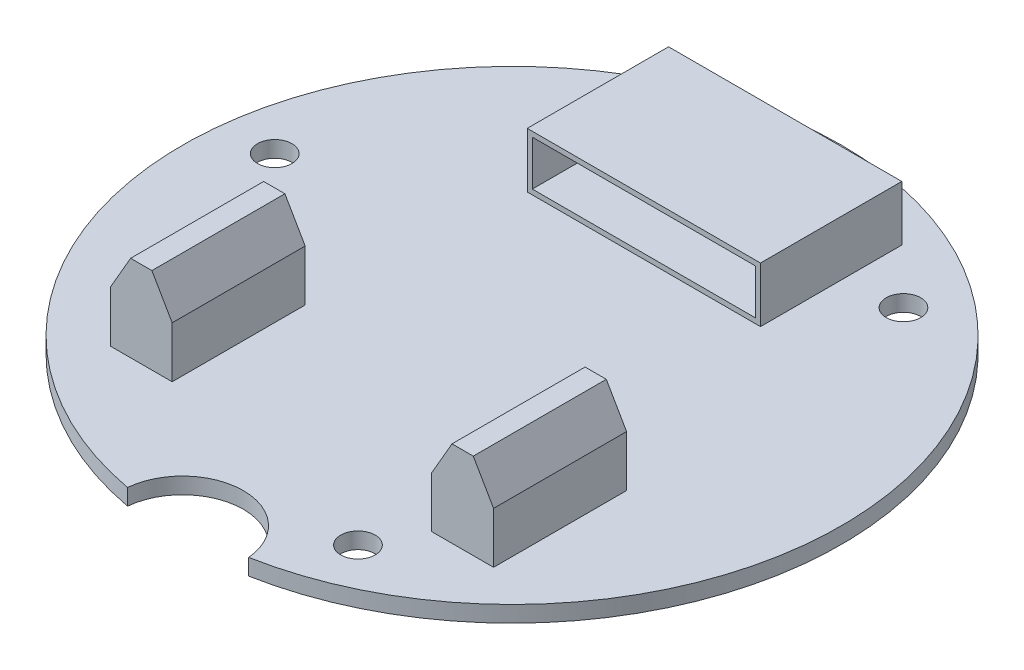
ISO-10303-21;
HEADER;
FILE_DESCRIPTION(('STEP AP214'),'2;1');
FILE_NAME('part.step','',(''),(''),'','','');
FILE_SCHEMA(('AUTOMOTIVE_DESIGN { 1 0 10303 214 1 1 1 1 }'));
ENDSEC;
DATA;
#1=APPLICATION_CONTEXT('core data for automotive mechanical design processes');
#2=APPLICATION_PROTOCOL_DEFINITION('international standard','automotive_design',2000,#1);
#3=PRODUCT_CONTEXT('',#1,'mechanical');
#4=PRODUCT('Part','Part','',(#3));
#5=PRODUCT_RELATED_PRODUCT_CATEGORY('part','',(#4));
#6=PRODUCT_DEFINITION_FORMATION('','',#4);
#7=PRODUCT_DEFINITION_CONTEXT('part definition',#1,'design');
#8=PRODUCT_DEFINITION('design','',#6,#7);
#9=PRODUCT_DEFINITION_SHAPE('','',#8);
#10=(LENGTH_UNIT() NAMED_UNIT(*) SI_UNIT(.MILLI.,.METRE.));
#11=(NAMED_UNIT(*) PLANE_ANGLE_UNIT() SI_UNIT($,.RADIAN.));
#12=(NAMED_UNIT(*) SI_UNIT($,.STERADIAN.) SOLID_ANGLE_UNIT());
#13=UNCERTAINTY_MEASURE_WITH_UNIT(LENGTH_MEASURE(1.E-05),#10,'distance_accuracy_value','');
#14=(GEOMETRIC_REPRESENTATION_CONTEXT(3) GLOBAL_UNCERTAINTY_ASSIGNED_CONTEXT((#13)) GLOBAL_UNIT_ASSIGNED_CONTEXT((#10,
#11,#12)) REPRESENTATION_CONTEXT('',''));
#15=CARTESIAN_POINT('',(0.,0.,0.));
#16=DIRECTION('',(0.,0.,1.));
#17=DIRECTION('',(1.,0.,0.));
#18=AXIS2_PLACEMENT_3D('',#15,#16,#17);
#19=CARTESIAN_POINT('',(0.,0.,16.25));
#20=DIRECTION('',(0.,1.,0.));
#21=DIRECTION('',(0.,0.,1.));
#22=AXIS2_PLACEMENT_3D('',#19,#20,#21);
#23=PLANE('',#22);
#24=DIRECTION('',(-1.,0.,0.));
#25=VECTOR('',#24,1.);
#26=CARTESIAN_POINT('',(12.8,0.,20.7191));
#27=LINE('',#26,#25);
#28=CARTESIAN_POINT('',(18.896,0.,20.7191));
#29=VERTEX_POINT('',#28);
#30=CARTESIAN_POINT('',(12.8,0.,20.7191));
#31=VERTEX_POINT('',#30);
#32=EDGE_CURVE('E256',#29,#31,#27,.T.);
#33=ORIENTED_EDGE('',*,*,#32,.F.);
#34=DIRECTION('',(0.,0.,1.));
#35=VECTOR('',#34,1.);
#36=CARTESIAN_POINT('',(18.896,0.,20.7191));
#37=LINE('',#36,#35);
#38=CARTESIAN_POINT('',(18.896,0.,7.6));
#39=VERTEX_POINT('',#38);
#40=EDGE_CURVE('E269',#39,#29,#37,.T.);
#41=ORIENTED_EDGE('',*,*,#40,.F.);
#42=DIRECTION('',(1.,0.,0.));
#43=VECTOR('',#42,1.);
#44=CARTESIAN_POINT('',(12.8,0.,7.6));
#45=LINE('',#44,#43);
#46=CARTESIAN_POINT('',(12.8,0.,7.6));
#47=VERTEX_POINT('',#46);
#48=EDGE_CURVE('E278',#47,#39,#45,.T.);
#49=ORIENTED_EDGE('',*,*,#48,.F.);
#50=DIRECTION('',(0.,0.,-1.));
#51=VECTOR('',#50,1.);
#52=CARTESIAN_POINT('',(12.8,0.,20.7191));
#53=LINE('',#52,#51);
#54=EDGE_CURVE('E259',#31,#47,#53,.T.);
#55=ORIENTED_EDGE('',*,*,#54,.F.);
#56=EDGE_LOOP('',(#33,#41,#49,#55));
#57=FACE_BOUND('',#56,.T.);
#58=CARTESIAN_POINT('',(16.9306905714555,0.,-21.670295724185));
#59=DIRECTION('',(0.,1.,0.));
#60=DIRECTION('',(0.866025403784436,0.,-0.500000000000004));
#61=AXIS2_PLACEMENT_3D('',#58,#59,#60);
#62=CIRCLE('',#61,1.7);
#63=CARTESIAN_POINT('',(18.402933757889,0.,-22.520295724185));
#64=VERTEX_POINT('',#63);
#65=EDGE_CURVE('E406',#64,#64,#62,.T.);
#66=ORIENTED_EDGE('',*,*,#65,.T.);
#67=EDGE_LOOP('',(#66));
#68=FACE_BOUND('',#67,.T.);
#69=CARTESIAN_POINT('',(-27.2323718903932,0.,-3.82726027640151));
#70=DIRECTION('',(0.,1.,0.));
#71=DIRECTION('',(-0.866025403784443,0.,-0.499999999999992));
#72=AXIS2_PLACEMENT_3D('',#69,#70,#71);
#73=CIRCLE('',#72,1.7);
#74=CARTESIAN_POINT('',(-28.7046150768268,0.,-4.6772602764015));
#75=VERTEX_POINT('',#74);
#76=EDGE_CURVE('E405',#75,#75,#73,.T.);
#77=ORIENTED_EDGE('',*,*,#76,.T.);
#78=EDGE_LOOP('',(#77));
#79=FACE_BOUND('',#78,.T.);
#80=CARTESIAN_POINT('',(10.3016813189376,0.,25.4975560005866));
#81=DIRECTION('',(0.,1.,0.));
#82=DIRECTION('',(0.,0.,1.));
#83=AXIS2_PLACEMENT_3D('',#80,#81,#82);
#84=CIRCLE('',#83,1.7);
#85=CARTESIAN_POINT('',(10.3016813189376,0.,27.1975560005866));
#86=VERTEX_POINT('',#85);
#87=EDGE_CURVE('E418',#86,#86,#84,.T.);
#88=ORIENTED_EDGE('',*,*,#87,.T.);
#89=EDGE_LOOP('',(#88));
#90=FACE_BOUND('',#89,.T.);
#91=CARTESIAN_POINT('',(0.,0.,0.));
#92=DIRECTION('',(0.,1.,0.));
#93=DIRECTION('',(0.,0.,1.));
#94=AXIS2_PLACEMENT_3D('',#91,#92,#93);
#95=CIRCLE('',#94,32.5);
#96=CARTESIAN_POINT('',(5.9743831847204,0.,31.9461538461538));
#97=VERTEX_POINT('',#96);
#98=CARTESIAN_POINT('',(-5.9743831847204,0.,31.9461538461538));
#99=VERTEX_POINT('',#98);
#100=EDGE_CURVE('E421',#97,#99,#95,.T.);
#101=ORIENTED_EDGE('',*,*,#100,.F.);
#102=CARTESIAN_POINT('',(0.,0.,32.5));
#103=DIRECTION('',(0.,1.,0.));
#104=DIRECTION('',(0.,0.,1.));
#105=AXIS2_PLACEMENT_3D('',#102,#103,#104);
#106=CIRCLE('',#105,6.00000000000001);
#107=EDGE_CURVE('E427',#97,#99,#106,.T.);
#108=ORIENTED_EDGE('',*,*,#107,.T.);
#109=EDGE_LOOP('',(#101,#108));
#110=FACE_BOUND('',#109,.T.);
#111=DIRECTION('',(0.,0.,1.));
#112=VECTOR('',#111,1.);
#113=CARTESIAN_POINT('',(-12.8,0.,20.7191));
#114=LINE('',#113,#112);
#115=CARTESIAN_POINT('',(-12.8,0.,7.6));
#116=VERTEX_POINT('',#115);
#117=CARTESIAN_POINT('',(-12.8,0.,20.7191));
#118=VERTEX_POINT('',#117);
#119=EDGE_CURVE('E255',#116,#118,#114,.T.);
#120=ORIENTED_EDGE('',*,*,#119,.F.);
#121=DIRECTION('',(1.,0.,0.));
#122=VECTOR('',#121,1.);
#123=CARTESIAN_POINT('',(-12.8,0.,7.6));
#124=LINE('',#123,#122);
#125=CARTESIAN_POINT('',(-18.896,0.,7.6));
#126=VERTEX_POINT('',#125);
#127=EDGE_CURVE('E252',#126,#116,#124,.T.);
#128=ORIENTED_EDGE('',*,*,#127,.F.);
#129=DIRECTION('',(0.,0.,-1.));
#130=VECTOR('',#129,1.);
#131=CARTESIAN_POINT('',(-18.896,0.,20.7191));
#132=LINE('',#131,#130);
#133=CARTESIAN_POINT('',(-18.896,0.,20.7191));
#134=VERTEX_POINT('',#133);
#135=EDGE_CURVE('E59',#134,#126,#132,.T.);
#136=ORIENTED_EDGE('',*,*,#135,.F.);
#137=DIRECTION('',(-1.,0.,0.));
#138=VECTOR('',#137,1.);
#139=CARTESIAN_POINT('',(-12.8,0.,20.7191));
#140=LINE('',#139,#138);
#141=EDGE_CURVE('E54',#118,#134,#140,.T.);
#142=ORIENTED_EDGE('',*,*,#141,.F.);
#143=EDGE_LOOP('',(#120,#128,#136,#142));
#144=FACE_BOUND('',#143,.T.);
#145=ADVANCED_FACE('F38',(#57,#68,#79,#90,#110,#144),#23,.F.);
#146=CARTESIAN_POINT('',(0.,1.6,16.25));
#147=DIRECTION('',(0.,1.,0.));
#148=DIRECTION('',(0.,0.,1.));
#149=AXIS2_PLACEMENT_3D('',#146,#147,#148);
#150=PLANE('',#149);
#151=CARTESIAN_POINT('',(16.9306905714555,1.6,-21.670295724185));
#152=DIRECTION('',(0.,1.,0.));
#153=DIRECTION('',(0.866025403784436,0.,-0.500000000000004));
#154=AXIS2_PLACEMENT_3D('',#151,#152,#153);
#155=CIRCLE('',#154,1.7);
#156=CARTESIAN_POINT('',(18.402933757889,1.6,-22.520295724185));
#157=VERTEX_POINT('',#156);
#158=EDGE_CURVE('E409',#157,#157,#155,.T.);
#159=ORIENTED_EDGE('',*,*,#158,.F.);
#160=EDGE_LOOP('',(#159));
#161=FACE_BOUND('',#160,.T.);
#162=CARTESIAN_POINT('',(-27.2323718903932,1.6,-3.82726027640151));
#163=DIRECTION('',(0.,1.,0.));
#164=DIRECTION('',(-0.866025403784443,0.,-0.499999999999992));
#165=AXIS2_PLACEMENT_3D('',#162,#163,#164);
#166=CIRCLE('',#165,1.7);
#167=CARTESIAN_POINT('',(-28.7046150768268,1.6,-4.6772602764015));
#168=VERTEX_POINT('',#167);
#169=EDGE_CURVE('E410',#168,#168,#166,.T.);
#170=ORIENTED_EDGE('',*,*,#169,.F.);
#171=EDGE_LOOP('',(#170));
#172=FACE_BOUND('',#171,.T.);
#173=CARTESIAN_POINT('',(10.3016813189376,1.6,25.4975560005866));
#174=DIRECTION('',(0.,1.,0.));
#175=DIRECTION('',(0.,0.,1.));
#176=AXIS2_PLACEMENT_3D('',#173,#174,#175);
#177=CIRCLE('',#176,1.7);
#178=CARTESIAN_POINT('',(10.3016813189376,1.6,27.1975560005866));
#179=VERTEX_POINT('',#178);
#180=EDGE_CURVE('E413',#179,#179,#177,.T.);
#181=ORIENTED_EDGE('',*,*,#180,.F.);
#182=EDGE_LOOP('',(#181));
#183=FACE_BOUND('',#182,.T.);
#184=CARTESIAN_POINT('',(0.,1.6,0.));
#185=DIRECTION('',(0.,1.,0.));
#186=DIRECTION('',(0.,0.,1.));
#187=AXIS2_PLACEMENT_3D('',#184,#185,#186);
#188=CIRCLE('',#187,32.5);
#189=CARTESIAN_POINT('',(5.9743831847204,1.6,31.9461538461538));
#190=VERTEX_POINT('',#189);
#191=CARTESIAN_POINT('',(-5.9743831847204,1.6,31.9461538461538));
#192=VERTEX_POINT('',#191);
#193=EDGE_CURVE('E424',#190,#192,#188,.T.);
#194=ORIENTED_EDGE('',*,*,#193,.T.);
#195=CARTESIAN_POINT('',(0.,1.6,32.5));
#196=DIRECTION('',(0.,1.,0.));
#197=DIRECTION('',(0.,0.,1.));
#198=AXIS2_PLACEMENT_3D('',#195,#196,#197);
#199=CIRCLE('',#198,6.00000000000001);
#200=EDGE_CURVE('E426',#190,#192,#199,.T.);
#201=ORIENTED_EDGE('',*,*,#200,.F.);
#202=EDGE_LOOP('',(#194,#201));
#203=FACE_BOUND('',#202,.T.);
#204=DIRECTION('',(-1.,0.,0.));
#205=VECTOR('',#204,1.);
#206=CARTESIAN_POINT('',(11.5,1.6,-26.9342933363348));
#207=LINE('',#206,#205);
#208=CARTESIAN_POINT('',(11.5,1.6,-26.9342933363348));
#209=VERTEX_POINT('',#208);
#210=CARTESIAN_POINT('',(-11.5,1.6,-26.9342933363348));
#211=VERTEX_POINT('',#210);
#212=EDGE_CURVE('E400',#209,#211,#207,.T.);
#213=ORIENTED_EDGE('',*,*,#212,.F.);
#214=DIRECTION('',(0.,0.,-1.));
#215=VECTOR('',#214,1.);
#216=CARTESIAN_POINT('',(11.5,1.6,-13.));
#217=LINE('',#216,#215);
#218=CARTESIAN_POINT('',(11.5,1.6,-13.));
#219=VERTEX_POINT('',#218);
#220=EDGE_CURVE('E379',#219,#209,#217,.T.);
#221=ORIENTED_EDGE('',*,*,#220,.F.);
#222=DIRECTION('',(-1.,0.,0.));
#223=VECTOR('',#222,1.);
#224=CARTESIAN_POINT('',(11.5,1.6,-13.));
#225=LINE('',#224,#223);
#226=CARTESIAN_POINT('',(-11.5,1.6,-13.));
#227=VERTEX_POINT('',#226);
#228=EDGE_CURVE('E403',#219,#227,#225,.T.);
#229=ORIENTED_EDGE('',*,*,#228,.T.);
#230=DIRECTION('',(0.,0.,-1.));
#231=VECTOR('',#230,1.);
#232=CARTESIAN_POINT('',(-11.5,1.6,-13.));
#233=LINE('',#232,#231);
#234=EDGE_CURVE('E390',#227,#211,#233,.T.);
#235=ORIENTED_EDGE('',*,*,#234,.T.);
#236=EDGE_LOOP('',(#213,#221,#229,#235));
#237=FACE_BOUND('',#236,.T.);
#238=DIRECTION('',(0.,0.,-1.));
#239=VECTOR('',#238,1.);
#240=CARTESIAN_POINT('',(18.896,1.6,20.7191));
#241=LINE('',#240,#239);
#242=CARTESIAN_POINT('',(18.896,1.6,20.7191));
#243=VERTEX_POINT('',#242);
#244=CARTESIAN_POINT('',(18.896,1.6,7.6));
#245=VERTEX_POINT('',#244);
#246=EDGE_CURVE('E361',#243,#245,#241,.T.);
#247=ORIENTED_EDGE('',*,*,#246,.F.);
#248=DIRECTION('',(1.,0.,0.));
#249=VECTOR('',#248,1.);
#250=CARTESIAN_POINT('',(12.8,1.6,20.7191));
#251=LINE('',#250,#249);
#252=CARTESIAN_POINT('',(12.8,1.6,20.7191));
#253=VERTEX_POINT('',#252);
#254=EDGE_CURVE('E351',#253,#243,#251,.T.);
#255=ORIENTED_EDGE('',*,*,#254,.F.);
#256=DIRECTION('',(0.,0.,-1.));
#257=VECTOR('',#256,1.);
#258=CARTESIAN_POINT('',(12.8,1.6,20.7191));
#259=LINE('',#258,#257);
#260=CARTESIAN_POINT('',(12.8,1.6,7.6));
#261=VERTEX_POINT('',#260);
#262=EDGE_CURVE('E372',#253,#261,#259,.T.);
#263=ORIENTED_EDGE('',*,*,#262,.T.);
#264=DIRECTION('',(1.,0.,0.));
#265=VECTOR('',#264,1.);
#266=CARTESIAN_POINT('',(12.8,1.6,7.6));
#267=LINE('',#266,#265);
#268=EDGE_CURVE('E363',#261,#245,#267,.T.);
#269=ORIENTED_EDGE('',*,*,#268,.T.);
#270=EDGE_LOOP('',(#247,#255,#263,#269));
#271=FACE_BOUND('',#270,.T.);
#272=DIRECTION('',(0.,0.,-1.));
#273=VECTOR('',#272,1.);
#274=CARTESIAN_POINT('',(-12.8,1.6,20.7191));
#275=LINE('',#274,#273);
#276=CARTESIAN_POINT('',(-12.8,1.6,20.7191));
#277=VERTEX_POINT('',#276);
#278=CARTESIAN_POINT('',(-12.8,1.6,7.6));
#279=VERTEX_POINT('',#278);
#280=EDGE_CURVE('E334',#277,#279,#275,.T.);
#281=ORIENTED_EDGE('',*,*,#280,.F.);
#282=DIRECTION('',(-1.,0.,0.));
#283=VECTOR('',#282,1.);
#284=CARTESIAN_POINT('',(-12.8,1.6,20.7191));
#285=LINE('',#284,#283);
#286=CARTESIAN_POINT('',(-18.896,1.6,20.7191));
#287=VERTEX_POINT('',#286);
#288=EDGE_CURVE('E332',#277,#287,#285,.T.);
#289=ORIENTED_EDGE('',*,*,#288,.T.);
#290=DIRECTION('',(0.,0.,-1.));
#291=VECTOR('',#290,1.);
#292=CARTESIAN_POINT('',(-18.896,1.6,20.7191));
#293=LINE('',#292,#291);
#294=CARTESIAN_POINT('',(-18.896,1.6,7.6));
#295=VERTEX_POINT('',#294);
#296=EDGE_CURVE('E346',#287,#295,#293,.T.);
#297=ORIENTED_EDGE('',*,*,#296,.T.);
#298=DIRECTION('',(-1.,0.,0.));
#299=VECTOR('',#298,1.);
#300=CARTESIAN_POINT('',(-12.8,1.6,7.6));
#301=LINE('',#300,#299);
#302=EDGE_CURVE('E326',#279,#295,#301,.T.);
#303=ORIENTED_EDGE('',*,*,#302,.F.);
#304=EDGE_LOOP('',(#281,#289,#297,#303));
#305=FACE_BOUND('',#304,.T.);
#306=ADVANCED_FACE('F499',(#161,#172,#183,#203,#237,#271,#305),#150,.T.);
#307=CARTESIAN_POINT('',(0.,1.6,0.));
#308=DIRECTION('',(0.,-1.,0.));
#309=DIRECTION('',(0.,0.,-1.));
#310=AXIS2_PLACEMENT_3D('',#307,#308,#309);
#311=CYLINDRICAL_SURFACE('',#310,32.5);
#312=ORIENTED_EDGE('',*,*,#100,.T.);
#313=DIRECTION('',(0.,-1.,0.));
#314=VECTOR('',#313,1.);
#315=CARTESIAN_POINT('',(-5.9743831847204,1.6,31.9461538461538));
#316=LINE('',#315,#314);
#317=EDGE_CURVE('E436',#192,#99,#316,.T.);
#318=ORIENTED_EDGE('',*,*,#317,.F.);
#319=ORIENTED_EDGE('',*,*,#193,.F.);
#320=DIRECTION('',(0.,-1.,0.));
#321=VECTOR('',#320,1.);
#322=CARTESIAN_POINT('',(5.9743831847204,1.6,31.9461538461538));
#323=LINE('',#322,#321);
#324=EDGE_CURVE('E430',#190,#97,#323,.T.);
#325=ORIENTED_EDGE('',*,*,#324,.T.);
#326=EDGE_LOOP('',(#312,#318,#319,#325));
#327=FACE_BOUND('',#326,.T.);
#328=ADVANCED_FACE('F501',(#327),#311,.T.);
#329=CARTESIAN_POINT('',(0.,1.6,32.5));
#330=DIRECTION('',(0.,-1.,0.));
#331=DIRECTION('',(0.,0.,-1.));
#332=AXIS2_PLACEMENT_3D('',#329,#330,#331);
#333=CYLINDRICAL_SURFACE('',#332,6.00000000000001);
#334=ORIENTED_EDGE('',*,*,#107,.F.);
#335=ORIENTED_EDGE('',*,*,#324,.F.);
#336=ORIENTED_EDGE('',*,*,#200,.T.);
#337=ORIENTED_EDGE('',*,*,#317,.T.);
#338=EDGE_LOOP('',(#334,#335,#336,#337));
#339=FACE_BOUND('',#338,.T.);
#340=ADVANCED_FACE('F508',(#339),#333,.F.);
#341=CARTESIAN_POINT('',(10.3016813189376,0.,25.4975560005866));
#342=DIRECTION('',(0.,1.,0.));
#343=DIRECTION('',(0.,0.,1.));
#344=AXIS2_PLACEMENT_3D('',#341,#342,#343);
#345=CYLINDRICAL_SURFACE('',#344,1.7);
#346=ORIENTED_EDGE('',*,*,#87,.F.);
#347=EDGE_LOOP('',(#346));
#348=FACE_BOUND('',#347,.T.);
#349=ORIENTED_EDGE('',*,*,#180,.T.);
#350=EDGE_LOOP('',(#349));
#351=FACE_BOUND('',#350,.T.);
#352=ADVANCED_FACE('F516',(#348,#351),#345,.F.);
#353=CARTESIAN_POINT('',(-27.2323718903932,0.,-3.82726027640151));
#354=DIRECTION('',(0.,1.,0.));
#355=DIRECTION('',(-0.866025403784443,0.,-0.499999999999992));
#356=AXIS2_PLACEMENT_3D('',#353,#354,#355);
#357=CYLINDRICAL_SURFACE('',#356,1.7);
#358=ORIENTED_EDGE('',*,*,#76,.F.);
#359=EDGE_LOOP('',(#358));
#360=FACE_BOUND('',#359,.T.);
#361=ORIENTED_EDGE('',*,*,#169,.T.);
#362=EDGE_LOOP('',(#361));
#363=FACE_BOUND('',#362,.T.);
#364=ADVANCED_FACE('F599',(#360,#363),#357,.F.);
#365=CARTESIAN_POINT('',(16.9306905714555,0.,-21.670295724185));
#366=DIRECTION('',(0.,1.,0.));
#367=DIRECTION('',(0.866025403784436,0.,-0.500000000000004));
#368=AXIS2_PLACEMENT_3D('',#365,#366,#367);
#369=CYLINDRICAL_SURFACE('',#368,1.7);
#370=ORIENTED_EDGE('',*,*,#65,.F.);
#371=EDGE_LOOP('',(#370));
#372=FACE_BOUND('',#371,.T.);
#373=ORIENTED_EDGE('',*,*,#158,.T.);
#374=EDGE_LOOP('',(#373));
#375=FACE_BOUND('',#374,.T.);
#376=ADVANCED_FACE('F596',(#372,#375),#369,.F.);
#377=CARTESIAN_POINT('',(11.5,1.6,-13.));
#378=DIRECTION('',(0.,0.,-1.));
#379=DIRECTION('',(0.,1.,0.));
#380=AXIS2_PLACEMENT_3D('',#377,#378,#379);
#381=PLANE('',#380);
#382=DIRECTION('',(0.,-1.,0.));
#383=VECTOR('',#382,1.);
#384=CARTESIAN_POINT('',(-11.,6.5356,-13.));
#385=LINE('',#384,#383);
#386=CARTESIAN_POINT('',(-11.,6.5356,-13.));
#387=VERTEX_POINT('',#386);
#388=CARTESIAN_POINT('',(-11.,2.1,-13.));
#389=VERTEX_POINT('',#388);
#390=EDGE_CURVE('E304',#387,#389,#385,.T.);
#391=ORIENTED_EDGE('',*,*,#390,.F.);
#392=DIRECTION('',(-1.,0.,0.));
#393=VECTOR('',#392,1.);
#394=CARTESIAN_POINT('',(11.,6.5356,-13.));
#395=LINE('',#394,#393);
#396=CARTESIAN_POINT('',(11.,6.5356,-13.));
#397=VERTEX_POINT('',#396);
#398=EDGE_CURVE('E294',#397,#387,#395,.T.);
#399=ORIENTED_EDGE('',*,*,#398,.F.);
#400=DIRECTION('',(0.,1.,0.));
#401=VECTOR('',#400,1.);
#402=CARTESIAN_POINT('',(11.,2.1,-13.));
#403=LINE('',#402,#401);
#404=CARTESIAN_POINT('',(11.,2.1,-13.));
#405=VERTEX_POINT('',#404);
#406=EDGE_CURVE('E310',#405,#397,#403,.T.);
#407=ORIENTED_EDGE('',*,*,#406,.F.);
#408=DIRECTION('',(1.,0.,0.));
#409=VECTOR('',#408,1.);
#410=CARTESIAN_POINT('',(-11.,2.1,-13.));
#411=LINE('',#410,#409);
#412=EDGE_CURVE('E307',#389,#405,#411,.T.);
#413=ORIENTED_EDGE('',*,*,#412,.F.);
#414=EDGE_LOOP('',(#391,#399,#407,#413));
#415=FACE_BOUND('',#414,.T.);
#416=DIRECTION('',(0.,-1.,0.));
#417=VECTOR('',#416,1.);
#418=CARTESIAN_POINT('',(-11.5,1.6,-13.));
#419=LINE('',#418,#417);
#420=CARTESIAN_POINT('',(-11.5,7.0356,-13.));
#421=VERTEX_POINT('',#420);
#422=EDGE_CURVE('E375',#421,#227,#419,.T.);
#423=ORIENTED_EDGE('',*,*,#422,.T.);
#424=ORIENTED_EDGE('',*,*,#228,.F.);
#425=DIRECTION('',(0.,-1.,0.));
#426=VECTOR('',#425,1.);
#427=CARTESIAN_POINT('',(11.5,1.6,-13.));
#428=LINE('',#427,#426);
#429=CARTESIAN_POINT('',(11.5,7.0356,-13.));
#430=VERTEX_POINT('',#429);
#431=EDGE_CURVE('E376',#430,#219,#428,.T.);
#432=ORIENTED_EDGE('',*,*,#431,.F.);
#433=DIRECTION('',(-1.,0.,0.));
#434=VECTOR('',#433,1.);
#435=CARTESIAN_POINT('',(11.5,7.0356,-13.));
#436=LINE('',#435,#434);
#437=EDGE_CURVE('E387',#430,#421,#436,.T.);
#438=ORIENTED_EDGE('',*,*,#437,.T.);
#439=EDGE_LOOP('',(#423,#424,#432,#438));
#440=FACE_BOUND('',#439,.T.);
#441=ADVANCED_FACE('F592',(#415,#440),#381,.F.);
#442=CARTESIAN_POINT('',(11.5,1.6,-26.9342933363348));
#443=DIRECTION('',(0.,0.,1.));
#444=DIRECTION('',(1.,0.,0.));
#445=AXIS2_PLACEMENT_3D('',#442,#443,#444);
#446=PLANE('',#445);
#447=DIRECTION('',(0.,1.,0.));
#448=VECTOR('',#447,1.);
#449=CARTESIAN_POINT('',(-11.5,1.6,-26.9342933363348));
#450=LINE('',#449,#448);
#451=CARTESIAN_POINT('',(-11.5,7.0356,-26.9342933363348));
#452=VERTEX_POINT('',#451);
#453=EDGE_CURVE('E392',#211,#452,#450,.T.);
#454=ORIENTED_EDGE('',*,*,#453,.T.);
#455=DIRECTION('',(-1.,0.,0.));
#456=VECTOR('',#455,1.);
#457=CARTESIAN_POINT('',(11.5,7.0356,-26.9342933363348));
#458=LINE('',#457,#456);
#459=CARTESIAN_POINT('',(11.5,7.0356,-26.9342933363348));
#460=VERTEX_POINT('',#459);
#461=EDGE_CURVE('E397',#460,#452,#458,.T.);
#462=ORIENTED_EDGE('',*,*,#461,.F.);
#463=DIRECTION('',(0.,1.,0.));
#464=VECTOR('',#463,1.);
#465=CARTESIAN_POINT('',(11.5,1.6,-26.9342933363348));
#466=LINE('',#465,#464);
#467=EDGE_CURVE('E383',#209,#460,#466,.T.);
#468=ORIENTED_EDGE('',*,*,#467,.F.);
#469=ORIENTED_EDGE('',*,*,#212,.T.);
#470=EDGE_LOOP('',(#454,#462,#468,#469));
#471=FACE_BOUND('',#470,.T.);
#472=ADVANCED_FACE('F588',(#471),#446,.F.);
#473=CARTESIAN_POINT('',(11.5,7.0356,-13.));
#474=DIRECTION('',(0.,-1.,0.));
#475=DIRECTION('',(0.,0.,-1.));
#476=AXIS2_PLACEMENT_3D('',#473,#474,#475);
#477=PLANE('',#476);
#478=DIRECTION('',(0.,0.,1.));
#479=VECTOR('',#478,1.);
#480=CARTESIAN_POINT('',(-11.5,7.0356,-13.));
#481=LINE('',#480,#479);
#482=EDGE_CURVE('E380',#452,#421,#481,.T.);
#483=ORIENTED_EDGE('',*,*,#482,.T.);
#484=ORIENTED_EDGE('',*,*,#437,.F.);
#485=DIRECTION('',(0.,0.,1.));
#486=VECTOR('',#485,1.);
#487=CARTESIAN_POINT('',(11.5,7.0356,-13.));
#488=LINE('',#487,#486);
#489=EDGE_CURVE('E385',#460,#430,#488,.T.);
#490=ORIENTED_EDGE('',*,*,#489,.F.);
#491=ORIENTED_EDGE('',*,*,#461,.T.);
#492=EDGE_LOOP('',(#483,#484,#490,#491));
#493=FACE_BOUND('',#492,.T.);
#494=ADVANCED_FACE('F581',(#493),#477,.F.);
#495=CARTESIAN_POINT('',(11.5,0.,0.));
#496=DIRECTION('',(-1.,0.,0.));
#497=DIRECTION('',(0.,0.,1.));
#498=AXIS2_PLACEMENT_3D('',#495,#496,#497);
#499=PLANE('',#498);
#500=ORIENTED_EDGE('',*,*,#431,.T.);
#501=ORIENTED_EDGE('',*,*,#220,.T.);
#502=ORIENTED_EDGE('',*,*,#467,.T.);
#503=ORIENTED_EDGE('',*,*,#489,.T.);
#504=EDGE_LOOP('',(#500,#501,#502,#503));
#505=FACE_BOUND('',#504,.T.);
#506=ADVANCED_FACE('F578',(#505),#499,.F.);
#507=CARTESIAN_POINT('',(-11.5,0.,0.));
#508=DIRECTION('',(-1.,0.,0.));
#509=DIRECTION('',(0.,0.,1.));
#510=AXIS2_PLACEMENT_3D('',#507,#508,#509);
#511=PLANE('',#510);
#512=ORIENTED_EDGE('',*,*,#422,.F.);
#513=ORIENTED_EDGE('',*,*,#482,.F.);
#514=ORIENTED_EDGE('',*,*,#453,.F.);
#515=ORIENTED_EDGE('',*,*,#234,.F.);
#516=EDGE_LOOP('',(#512,#513,#514,#515));
#517=FACE_BOUND('',#516,.T.);
#518=ADVANCED_FACE('F576',(#517),#511,.T.);
#519=CARTESIAN_POINT('',(12.8,1.6,20.7191));
#520=DIRECTION('',(1.,0.,0.));
#521=DIRECTION('',(0.,0.,-1.));
#522=AXIS2_PLACEMENT_3D('',#519,#520,#521);
#523=PLANE('',#522);
#524=DIRECTION('',(0.,-1.,0.));
#525=VECTOR('',#524,1.);
#526=CARTESIAN_POINT('',(12.8,1.6,20.7191));
#527=LINE('',#526,#525);
#528=CARTESIAN_POINT('',(12.8,6.63589838486226,20.7191));
#529=VERTEX_POINT('',#528);
#530=EDGE_CURVE('E349',#529,#253,#527,.T.);
#531=ORIENTED_EDGE('',*,*,#530,.F.);
#532=DIRECTION('',(0.,0.,-1.));
#533=VECTOR('',#532,1.);
#534=CARTESIAN_POINT('',(12.8,6.63589838486226,20.7191));
#535=LINE('',#534,#533);
#536=CARTESIAN_POINT('',(12.8,6.63589838486226,7.6));
#537=VERTEX_POINT('',#536);
#538=EDGE_CURVE('E453',#529,#537,#535,.T.);
#539=ORIENTED_EDGE('',*,*,#538,.T.);
#540=DIRECTION('',(0.,-1.,0.));
#541=VECTOR('',#540,1.);
#542=CARTESIAN_POINT('',(12.8,1.6,7.6));
#543=LINE('',#542,#541);
#544=EDGE_CURVE('E348',#537,#261,#543,.T.);
#545=ORIENTED_EDGE('',*,*,#544,.T.);
#546=ORIENTED_EDGE('',*,*,#262,.F.);
#547=EDGE_LOOP('',(#531,#539,#545,#546));
#548=FACE_BOUND('',#547,.T.);
#549=ADVANCED_FACE('F572',(#548),#523,.F.);
#550=CARTESIAN_POINT('',(18.896,1.6,20.7191));
#551=DIRECTION('',(-1.,0.,0.));
#552=DIRECTION('',(0.,0.,1.));
#553=AXIS2_PLACEMENT_3D('',#550,#551,#552);
#554=PLANE('',#553);
#555=DIRECTION('',(0.,1.,0.));
#556=VECTOR('',#555,1.);
#557=CARTESIAN_POINT('',(18.896,1.6,7.6));
#558=LINE('',#557,#556);
#559=CARTESIAN_POINT('',(18.896,6.63589838486226,7.6));
#560=VERTEX_POINT('',#559);
#561=EDGE_CURVE('E365',#245,#560,#558,.T.);
#562=ORIENTED_EDGE('',*,*,#561,.T.);
#563=DIRECTION('',(0.,0.,1.));
#564=VECTOR('',#563,1.);
#565=CARTESIAN_POINT('',(18.896,6.63589838486226,20.7191));
#566=LINE('',#565,#564);
#567=CARTESIAN_POINT('',(18.896,6.63589838486226,20.7191));
#568=VERTEX_POINT('',#567);
#569=EDGE_CURVE('E447',#560,#568,#566,.T.);
#570=ORIENTED_EDGE('',*,*,#569,.T.);
#571=DIRECTION('',(0.,1.,0.));
#572=VECTOR('',#571,1.);
#573=CARTESIAN_POINT('',(18.896,1.6,20.7191));
#574=LINE('',#573,#572);
#575=EDGE_CURVE('E355',#243,#568,#574,.T.);
#576=ORIENTED_EDGE('',*,*,#575,.F.);
#577=ORIENTED_EDGE('',*,*,#246,.T.);
#578=EDGE_LOOP('',(#562,#570,#576,#577));
#579=FACE_BOUND('',#578,.T.);
#580=ADVANCED_FACE('F568',(#579),#554,.F.);
#581=CARTESIAN_POINT('',(12.8,10.1,20.7191));
#582=DIRECTION('',(0.,-1.,0.));
#583=DIRECTION('',(0.,0.,-1.));
#584=AXIS2_PLACEMENT_3D('',#581,#582,#583);
#585=PLANE('',#584);
#586=DIRECTION('',(-1.,0.,0.));
#587=VECTOR('',#586,1.);
#588=CARTESIAN_POINT('',(12.8,10.1,20.7191));
#589=LINE('',#588,#587);
#590=CARTESIAN_POINT('',(16.896,10.1,20.7191));
#591=VERTEX_POINT('',#590);
#592=CARTESIAN_POINT('',(14.8,10.1,20.7191));
#593=VERTEX_POINT('',#592);
#594=EDGE_CURVE('E358',#591,#593,#589,.T.);
#595=ORIENTED_EDGE('',*,*,#594,.F.);
#596=DIRECTION('',(0.,0.,-1.));
#597=VECTOR('',#596,1.);
#598=CARTESIAN_POINT('',(16.896,10.1,20.7191));
#599=LINE('',#598,#597);
#600=CARTESIAN_POINT('',(16.896,10.1,7.6));
#601=VERTEX_POINT('',#600);
#602=EDGE_CURVE('E440',#591,#601,#599,.T.);
#603=ORIENTED_EDGE('',*,*,#602,.T.);
#604=DIRECTION('',(-1.,0.,0.));
#605=VECTOR('',#604,1.);
#606=CARTESIAN_POINT('',(12.8,10.1,7.6));
#607=LINE('',#606,#605);
#608=CARTESIAN_POINT('',(14.8,10.1,7.6));
#609=VERTEX_POINT('',#608);
#610=EDGE_CURVE('E352',#601,#609,#607,.T.);
#611=ORIENTED_EDGE('',*,*,#610,.T.);
#612=DIRECTION('',(0.,0.,1.));
#613=VECTOR('',#612,1.);
#614=CARTESIAN_POINT('',(14.8,10.1,20.7191));
#615=LINE('',#614,#613);
#616=EDGE_CURVE('E438',#609,#593,#615,.T.);
#617=ORIENTED_EDGE('',*,*,#616,.T.);
#618=EDGE_LOOP('',(#595,#603,#611,#617));
#619=FACE_BOUND('',#618,.T.);
#620=ADVANCED_FACE('F561',(#619),#585,.F.);
#621=CARTESIAN_POINT('',(0.,0.,20.7191));
#622=DIRECTION('',(0.,0.,-1.));
#623=DIRECTION('',(-1.,0.,0.));
#624=AXIS2_PLACEMENT_3D('',#621,#622,#623);
#625=PLANE('',#624);
#626=ORIENTED_EDGE('',*,*,#575,.T.);
#627=DIRECTION('',(0.500000000000002,-0.866025403784438,0.));
#628=VECTOR('',#627,1.);
#629=CARTESIAN_POINT('',(16.896,10.1,20.7191));
#630=LINE('',#629,#628);
#631=EDGE_CURVE('E451',#568,#591,#630,.F.);
#632=ORIENTED_EDGE('',*,*,#631,.T.);
#633=ORIENTED_EDGE('',*,*,#594,.T.);
#634=DIRECTION('',(0.500000000000002,0.866025403784438,0.));
#635=VECTOR('',#634,1.);
#636=CARTESIAN_POINT('',(12.8,6.63589838486226,20.7191));
#637=LINE('',#636,#635);
#638=EDGE_CURVE('E449',#593,#529,#637,.F.);
#639=ORIENTED_EDGE('',*,*,#638,.T.);
#640=ORIENTED_EDGE('',*,*,#530,.T.);
#641=ORIENTED_EDGE('',*,*,#254,.T.);
#642=EDGE_LOOP('',(#626,#632,#633,#639,#640,#641));
#643=FACE_BOUND('',#642,.T.);
#644=ADVANCED_FACE('F558',(#643),#625,.F.);
#645=CARTESIAN_POINT('',(0.,0.,7.6));
#646=DIRECTION('',(0.,0.,-1.));
#647=DIRECTION('',(-1.,0.,0.));
#648=AXIS2_PLACEMENT_3D('',#645,#646,#647);
#649=PLANE('',#648);
#650=ORIENTED_EDGE('',*,*,#610,.F.);
#651=DIRECTION('',(-0.500000000000002,0.866025403784438,0.));
#652=VECTOR('',#651,1.);
#653=CARTESIAN_POINT('',(17.0454282891114,9.84118261117097,7.6));
#654=LINE('',#653,#652);
#655=EDGE_CURVE('E445',#601,#560,#654,.F.);
#656=ORIENTED_EDGE('',*,*,#655,.T.);
#657=ORIENTED_EDGE('',*,*,#561,.F.);
#658=ORIENTED_EDGE('',*,*,#268,.F.);
#659=ORIENTED_EDGE('',*,*,#544,.F.);
#660=DIRECTION('',(-0.500000000000002,-0.866025403784438,0.));
#661=VECTOR('',#660,1.);
#662=CARTESIAN_POINT('',(6.72657171088855,-3.88358798800484,7.6));
#663=LINE('',#662,#661);
#664=EDGE_CURVE('E443',#537,#609,#663,.F.);
#665=ORIENTED_EDGE('',*,*,#664,.T.);
#666=EDGE_LOOP('',(#650,#656,#657,#658,#659,#665));
#667=FACE_BOUND('',#666,.T.);
#668=ADVANCED_FACE('F530',(#667),#649,.T.);
#669=CARTESIAN_POINT('',(16.896,10.1,20.7191));
#670=DIRECTION('',(-0.866025403784438,-0.500000000000002,0.));
#671=DIRECTION('',(0.,0.,-1.));
#672=AXIS2_PLACEMENT_3D('',#669,#670,#671);
#673=PLANE('',#672);
#674=ORIENTED_EDGE('',*,*,#631,.F.);
#675=ORIENTED_EDGE('',*,*,#569,.F.);
#676=ORIENTED_EDGE('',*,*,#655,.F.);
#677=ORIENTED_EDGE('',*,*,#602,.F.);
#678=EDGE_LOOP('',(#674,#675,#676,#677));
#679=FACE_BOUND('',#678,.T.);
#680=ADVANCED_FACE('F523',(#679),#673,.F.);
#681=CARTESIAN_POINT('',(12.8,6.63589838486226,20.7191));
#682=DIRECTION('',(0.866025403784438,-0.500000000000002,0.));
#683=DIRECTION('',(0.,0.,-1.));
#684=AXIS2_PLACEMENT_3D('',#681,#682,#683);
#685=PLANE('',#684);
#686=ORIENTED_EDGE('',*,*,#638,.F.);
#687=ORIENTED_EDGE('',*,*,#616,.F.);
#688=ORIENTED_EDGE('',*,*,#664,.F.);
#689=ORIENTED_EDGE('',*,*,#538,.F.);
#690=EDGE_LOOP('',(#686,#687,#688,#689));
#691=FACE_BOUND('',#690,.T.);
#692=ADVANCED_FACE('F529',(#691),#685,.F.);
#693=CARTESIAN_POINT('',(-12.8,1.6,20.7191));
#694=DIRECTION('',(1.,0.,0.));
#695=DIRECTION('',(0.,0.,-1.));
#696=AXIS2_PLACEMENT_3D('',#693,#694,#695);
#697=PLANE('',#696);
#698=DIRECTION('',(0.,-1.,0.));
#699=VECTOR('',#698,1.);
#700=CARTESIAN_POINT('',(-12.8,1.6,7.6));
#701=LINE('',#700,#699);
#702=CARTESIAN_POINT('',(-12.8,6.63589838486226,7.6));
#703=VERTEX_POINT('',#702);
#704=EDGE_CURVE('E322',#703,#279,#701,.T.);
#705=ORIENTED_EDGE('',*,*,#704,.F.);
#706=DIRECTION('',(0.,0.,1.));
#707=VECTOR('',#706,1.);
#708=CARTESIAN_POINT('',(-12.8,6.63589838486226,20.7191));
#709=LINE('',#708,#707);
#710=CARTESIAN_POINT('',(-12.8,6.63589838486226,20.7191));
#711=VERTEX_POINT('',#710);
#712=EDGE_CURVE('E12',#703,#711,#709,.T.);
#713=ORIENTED_EDGE('',*,*,#712,.T.);
#714=DIRECTION('',(0.,-1.,0.));
#715=VECTOR('',#714,1.);
#716=CARTESIAN_POINT('',(-12.8,1.6,20.7191));
#717=LINE('',#716,#715);
#718=EDGE_CURVE('E323',#711,#277,#717,.T.);
#719=ORIENTED_EDGE('',*,*,#718,.T.);
#720=ORIENTED_EDGE('',*,*,#280,.T.);
#721=EDGE_LOOP('',(#705,#713,#719,#720));
#722=FACE_BOUND('',#721,.T.);
#723=ADVANCED_FACE('F495',(#722),#697,.T.);
#724=CARTESIAN_POINT('',(-12.8,10.1,20.7191));
#725=DIRECTION('',(0.,1.,0.));
#726=DIRECTION('',(0.,0.,1.));
#727=AXIS2_PLACEMENT_3D('',#724,#725,#726);
#728=PLANE('',#727);
#729=DIRECTION('',(1.,0.,0.));
#730=VECTOR('',#729,1.);
#731=CARTESIAN_POINT('',(-12.8,10.1,7.6));
#732=LINE('',#731,#730);
#733=CARTESIAN_POINT('',(-16.896,10.1,7.6));
#734=VERTEX_POINT('',#733);
#735=CARTESIAN_POINT('',(-14.8,10.1,7.6));
#736=VERTEX_POINT('',#735);
#737=EDGE_CURVE('E336',#734,#736,#732,.T.);
#738=ORIENTED_EDGE('',*,*,#737,.F.);
#739=DIRECTION('',(0.,0.,1.));
#740=VECTOR('',#739,1.);
#741=CARTESIAN_POINT('',(-16.896,10.1,20.7191));
#742=LINE('',#741,#740);
#743=CARTESIAN_POINT('',(-16.896,10.1,20.7191));
#744=VERTEX_POINT('',#743);
#745=EDGE_CURVE('E466',#734,#744,#742,.T.);
#746=ORIENTED_EDGE('',*,*,#745,.T.);
#747=DIRECTION('',(1.,0.,0.));
#748=VECTOR('',#747,1.);
#749=CARTESIAN_POINT('',(-12.8,10.1,20.7191));
#750=LINE('',#749,#748);
#751=CARTESIAN_POINT('',(-14.8,10.1,20.7191));
#752=VERTEX_POINT('',#751);
#753=EDGE_CURVE('E325',#744,#752,#750,.T.);
#754=ORIENTED_EDGE('',*,*,#753,.T.);
#755=DIRECTION('',(0.,0.,-1.));
#756=VECTOR('',#755,1.);
#757=CARTESIAN_POINT('',(-14.8,10.1,20.7191));
#758=LINE('',#757,#756);
#759=EDGE_CURVE('E463',#752,#736,#758,.T.);
#760=ORIENTED_EDGE('',*,*,#759,.T.);
#761=EDGE_LOOP('',(#738,#746,#754,#760));
#762=FACE_BOUND('',#761,.T.);
#763=ADVANCED_FACE('F487',(#762),#728,.T.);
#764=CARTESIAN_POINT('',(-18.896,1.6,20.7191));
#765=DIRECTION('',(-1.,0.,0.));
#766=DIRECTION('',(0.,0.,1.));
#767=AXIS2_PLACEMENT_3D('',#764,#765,#766);
#768=PLANE('',#767);
#769=DIRECTION('',(0.,1.,0.));
#770=VECTOR('',#769,1.);
#771=CARTESIAN_POINT('',(-18.896,1.6,20.7191));
#772=LINE('',#771,#770);
#773=CARTESIAN_POINT('',(-18.896,6.63589838486226,20.7191));
#774=VERTEX_POINT('',#773);
#775=EDGE_CURVE('E329',#287,#774,#772,.T.);
#776=ORIENTED_EDGE('',*,*,#775,.T.);
#777=DIRECTION('',(0.,0.,-1.));
#778=VECTOR('',#777,1.);
#779=CARTESIAN_POINT('',(-18.896,6.63589838486226,20.7191));
#780=LINE('',#779,#778);
#781=CARTESIAN_POINT('',(-18.896,6.63589838486226,7.6));
#782=VERTEX_POINT('',#781);
#783=EDGE_CURVE('E456',#774,#782,#780,.T.);
#784=ORIENTED_EDGE('',*,*,#783,.T.);
#785=DIRECTION('',(0.,1.,0.));
#786=VECTOR('',#785,1.);
#787=CARTESIAN_POINT('',(-18.896,1.6,7.6));
#788=LINE('',#787,#786);
#789=EDGE_CURVE('E339',#295,#782,#788,.T.);
#790=ORIENTED_EDGE('',*,*,#789,.F.);
#791=ORIENTED_EDGE('',*,*,#296,.F.);
#792=EDGE_LOOP('',(#776,#784,#790,#791));
#793=FACE_BOUND('',#792,.T.);
#794=ADVANCED_FACE('F480',(#793),#768,.T.);
#795=CARTESIAN_POINT('',(0.,0.,20.7191));
#796=DIRECTION('',(0.,0.,-1.));
#797=DIRECTION('',(1.,0.,0.));
#798=AXIS2_PLACEMENT_3D('',#795,#796,#797);
#799=PLANE('',#798);
#800=ORIENTED_EDGE('',*,*,#753,.F.);
#801=DIRECTION('',(0.500000000000002,0.866025403784438,0.));
#802=VECTOR('',#801,1.);
#803=CARTESIAN_POINT('',(-18.896,6.63589838486226,20.7191));
#804=LINE('',#803,#802);
#805=EDGE_CURVE('E47',#744,#774,#804,.F.);
#806=ORIENTED_EDGE('',*,*,#805,.T.);
#807=ORIENTED_EDGE('',*,*,#775,.F.);
#808=ORIENTED_EDGE('',*,*,#288,.F.);
#809=ORIENTED_EDGE('',*,*,#718,.F.);
#810=DIRECTION('',(0.500000000000002,-0.866025403784438,0.));
#811=VECTOR('',#810,1.);
#812=CARTESIAN_POINT('',(-14.8,10.1,20.7191));
#813=LINE('',#812,#811);
#814=EDGE_CURVE('E468',#711,#752,#813,.F.);
#815=ORIENTED_EDGE('',*,*,#814,.T.);
#816=EDGE_LOOP('',(#800,#806,#807,#808,#809,#815));
#817=FACE_BOUND('',#816,.T.);
#818=ADVANCED_FACE('F473',(#817),#799,.F.);
#819=CARTESIAN_POINT('',(0.,0.,7.6));
#820=DIRECTION('',(0.,0.,-1.));
#821=DIRECTION('',(1.,0.,0.));
#822=AXIS2_PLACEMENT_3D('',#819,#820,#821);
#823=PLANE('',#822);
#824=ORIENTED_EDGE('',*,*,#789,.T.);
#825=DIRECTION('',(-0.500000000000002,-0.866025403784438,0.));
#826=VECTOR('',#825,1.);
#827=CARTESIAN_POINT('',(-17.0454282891114,9.84118261117097,7.6));
#828=LINE('',#827,#826);
#829=EDGE_CURVE('E461',#782,#734,#828,.F.);
#830=ORIENTED_EDGE('',*,*,#829,.T.);
#831=ORIENTED_EDGE('',*,*,#737,.T.);
#832=DIRECTION('',(-0.500000000000002,0.866025403784438,0.));
#833=VECTOR('',#832,1.);
#834=CARTESIAN_POINT('',(-6.72657171088855,-3.88358798800484,7.6));
#835=LINE('',#834,#833);
#836=EDGE_CURVE('E459',#736,#703,#835,.F.);
#837=ORIENTED_EDGE('',*,*,#836,.T.);
#838=ORIENTED_EDGE('',*,*,#704,.T.);
#839=ORIENTED_EDGE('',*,*,#302,.T.);
#840=EDGE_LOOP('',(#824,#830,#831,#837,#838,#839));
#841=FACE_BOUND('',#840,.T.);
#842=ADVANCED_FACE('F485',(#841),#823,.T.);
#843=CARTESIAN_POINT('',(-18.896,6.63589838486226,20.7191));
#844=DIRECTION('',(0.866025403784438,-0.500000000000002,0.));
#845=DIRECTION('',(0.,0.,-1.));
#846=AXIS2_PLACEMENT_3D('',#843,#844,#845);
#847=PLANE('',#846);
#848=ORIENTED_EDGE('',*,*,#805,.F.);
#849=ORIENTED_EDGE('',*,*,#745,.F.);
#850=ORIENTED_EDGE('',*,*,#829,.F.);
#851=ORIENTED_EDGE('',*,*,#783,.F.);
#852=EDGE_LOOP('',(#848,#849,#850,#851));
#853=FACE_BOUND('',#852,.T.);
#854=ADVANCED_FACE('F482',(#853),#847,.F.);
#855=CARTESIAN_POINT('',(-14.8,10.1,20.7191));
#856=DIRECTION('',(-0.866025403784438,-0.500000000000002,0.));
#857=DIRECTION('',(0.,0.,-1.));
#858=AXIS2_PLACEMENT_3D('',#855,#856,#857);
#859=PLANE('',#858);
#860=ORIENTED_EDGE('',*,*,#814,.F.);
#861=ORIENTED_EDGE('',*,*,#712,.F.);
#862=ORIENTED_EDGE('',*,*,#836,.F.);
#863=ORIENTED_EDGE('',*,*,#759,.F.);
#864=EDGE_LOOP('',(#860,#861,#862,#863));
#865=FACE_BOUND('',#864,.T.);
#866=ADVANCED_FACE('F41',(#865),#859,.F.);
#867=CARTESIAN_POINT('',(11.,6.5356,-49.3769880800593));
#868=DIRECTION('',(0.,1.,0.));
#869=DIRECTION('',(0.,0.,1.));
#870=AXIS2_PLACEMENT_3D('',#867,#868,#869);
#871=PLANE('',#870);
#872=DIRECTION('',(1.,0.,0.));
#873=VECTOR('',#872,1.);
#874=CARTESIAN_POINT('',(11.,6.5356,-26.4342933363348));
#875=LINE('',#874,#873);
#876=CARTESIAN_POINT('',(-11.,6.5356,-26.4342933363348));
#877=VERTEX_POINT('',#876);
#878=CARTESIAN_POINT('',(11.,6.5356,-26.4342933363348));
#879=VERTEX_POINT('',#878);
#880=EDGE_CURVE('E300',#877,#879,#875,.T.);
#881=ORIENTED_EDGE('',*,*,#880,.T.);
#882=DIRECTION('',(0.,0.,1.));
#883=VECTOR('',#882,1.);
#884=CARTESIAN_POINT('',(11.,6.5356,-49.3769880800593));
#885=LINE('',#884,#883);
#886=EDGE_CURVE('E298',#879,#397,#885,.T.);
#887=ORIENTED_EDGE('',*,*,#886,.T.);
#888=ORIENTED_EDGE('',*,*,#398,.T.);
#889=DIRECTION('',(0.,0.,1.));
#890=VECTOR('',#889,1.);
#891=CARTESIAN_POINT('',(-11.,6.5356,-49.3769880800593));
#892=LINE('',#891,#890);
#893=EDGE_CURVE('E313',#877,#387,#892,.T.);
#894=ORIENTED_EDGE('',*,*,#893,.F.);
#895=EDGE_LOOP('',(#881,#887,#888,#894));
#896=FACE_BOUND('',#895,.T.);
#897=ADVANCED_FACE('F544',(#896),#871,.F.);
#898=CARTESIAN_POINT('',(11.,2.1,-49.3769880800593));
#899=DIRECTION('',(1.,0.,0.));
#900=DIRECTION('',(0.,0.,-1.));
#901=AXIS2_PLACEMENT_3D('',#898,#899,#900);
#902=PLANE('',#901);
#903=DIRECTION('',(0.,-1.,0.));
#904=VECTOR('',#903,1.);
#905=CARTESIAN_POINT('',(11.,2.1,-26.4342933363348));
#906=LINE('',#905,#904);
#907=CARTESIAN_POINT('',(11.,2.1,-26.4342933363348));
#908=VERTEX_POINT('',#907);
#909=EDGE_CURVE('E297',#879,#908,#906,.T.);
#910=ORIENTED_EDGE('',*,*,#909,.T.);
#911=DIRECTION('',(0.,0.,1.));
#912=VECTOR('',#911,1.);
#913=CARTESIAN_POINT('',(11.,2.1,-49.3769880800593));
#914=LINE('',#913,#912);
#915=EDGE_CURVE('E315',#908,#405,#914,.T.);
#916=ORIENTED_EDGE('',*,*,#915,.T.);
#917=ORIENTED_EDGE('',*,*,#406,.T.);
#918=ORIENTED_EDGE('',*,*,#886,.F.);
#919=EDGE_LOOP('',(#910,#916,#917,#918));
#920=FACE_BOUND('',#919,.T.);
#921=ADVANCED_FACE('F699',(#920),#902,.F.);
#922=CARTESIAN_POINT('',(-11.,2.1,-49.3769880800593));
#923=DIRECTION('',(0.,-1.,0.));
#924=DIRECTION('',(0.,0.,-1.));
#925=AXIS2_PLACEMENT_3D('',#922,#923,#924);
#926=PLANE('',#925);
#927=DIRECTION('',(-1.,0.,0.));
#928=VECTOR('',#927,1.);
#929=CARTESIAN_POINT('',(-11.,2.1,-26.4342933363348));
#930=LINE('',#929,#928);
#931=CARTESIAN_POINT('',(-11.,2.1,-26.4342933363348));
#932=VERTEX_POINT('',#931);
#933=EDGE_CURVE('E295',#908,#932,#930,.T.);
#934=ORIENTED_EDGE('',*,*,#933,.T.);
#935=DIRECTION('',(0.,0.,1.));
#936=VECTOR('',#935,1.);
#937=CARTESIAN_POINT('',(-11.,2.1,-49.3769880800593));
#938=LINE('',#937,#936);
#939=EDGE_CURVE('E317',#932,#389,#938,.T.);
#940=ORIENTED_EDGE('',*,*,#939,.T.);
#941=ORIENTED_EDGE('',*,*,#412,.T.);
#942=ORIENTED_EDGE('',*,*,#915,.F.);
#943=EDGE_LOOP('',(#934,#940,#941,#942));
#944=FACE_BOUND('',#943,.T.);
#945=ADVANCED_FACE('F702',(#944),#926,.F.);
#946=CARTESIAN_POINT('',(-11.,6.5356,-49.3769880800593));
#947=DIRECTION('',(-1.,0.,0.));
#948=DIRECTION('',(0.,0.,1.));
#949=AXIS2_PLACEMENT_3D('',#946,#947,#948);
#950=PLANE('',#949);
#951=DIRECTION('',(0.,1.,0.));
#952=VECTOR('',#951,1.);
#953=CARTESIAN_POINT('',(-11.,6.5356,-26.4342933363348));
#954=LINE('',#953,#952);
#955=EDGE_CURVE('E302',#932,#877,#954,.T.);
#956=ORIENTED_EDGE('',*,*,#955,.T.);
#957=ORIENTED_EDGE('',*,*,#893,.T.);
#958=ORIENTED_EDGE('',*,*,#390,.T.);
#959=ORIENTED_EDGE('',*,*,#939,.F.);
#960=EDGE_LOOP('',(#956,#957,#958,#959));
#961=FACE_BOUND('',#960,.T.);
#962=ADVANCED_FACE('F697',(#961),#950,.F.);
#963=CARTESIAN_POINT('',(11.5,1.6,-26.4342933363348));
#964=DIRECTION('',(0.,0.,1.));
#965=DIRECTION('',(1.,0.,0.));
#966=AXIS2_PLACEMENT_3D('',#963,#964,#965);
#967=PLANE('',#966);
#968=ORIENTED_EDGE('',*,*,#880,.F.);
#969=ORIENTED_EDGE('',*,*,#955,.F.);
#970=ORIENTED_EDGE('',*,*,#933,.F.);
#971=ORIENTED_EDGE('',*,*,#909,.F.);
#972=EDGE_LOOP('',(#968,#969,#970,#971));
#973=FACE_BOUND('',#972,.T.);
#974=ADVANCED_FACE('F693',(#973),#967,.T.);
#975=CARTESIAN_POINT('',(12.8,-2.,20.7191));
#976=DIRECTION('',(0.,0.,-1.));
#977=DIRECTION('',(-1.,0.,0.));
#978=AXIS2_PLACEMENT_3D('',#975,#976,#977);
#979=PLANE('',#978);
#980=ORIENTED_EDGE('',*,*,#32,.T.);
#981=DIRECTION('',(0.,1.,0.));
#982=VECTOR('',#981,1.);
#983=CARTESIAN_POINT('',(12.8,-2.,20.7191));
#984=LINE('',#983,#982);
#985=CARTESIAN_POINT('',(12.8,-2.,20.7191));
#986=VERTEX_POINT('',#985);
#987=EDGE_CURVE('E291',#986,#31,#984,.T.);
#988=ORIENTED_EDGE('',*,*,#987,.F.);
#989=DIRECTION('',(-1.,0.,0.));
#990=VECTOR('',#989,1.);
#991=CARTESIAN_POINT('',(12.8,-2.,20.7191));
#992=LINE('',#991,#990);
#993=CARTESIAN_POINT('',(18.896,-2.,20.7191));
#994=VERTEX_POINT('',#993);
#995=EDGE_CURVE('E265',#994,#986,#992,.T.);
#996=ORIENTED_EDGE('',*,*,#995,.F.);
#997=DIRECTION('',(0.,1.,0.));
#998=VECTOR('',#997,1.);
#999=CARTESIAN_POINT('',(18.896,-2.,20.7191));
#1000=LINE('',#999,#998);
#1001=EDGE_CURVE('E274',#994,#29,#1000,.T.);
#1002=ORIENTED_EDGE('',*,*,#1001,.T.);
#1003=EDGE_LOOP('',(#980,#988,#996,#1002));
#1004=FACE_BOUND('',#1003,.T.);
#1005=ADVANCED_FACE('F689',(#1004),#979,.F.);
#1006=CARTESIAN_POINT('',(12.8,-2.,20.7191));
#1007=DIRECTION('',(1.,0.,0.));
#1008=DIRECTION('',(0.,0.,-1.));
#1009=AXIS2_PLACEMENT_3D('',#1006,#1007,#1008);
#1010=PLANE('',#1009);
#1011=ORIENTED_EDGE('',*,*,#54,.T.);
#1012=DIRECTION('',(0.,1.,0.));
#1013=VECTOR('',#1012,1.);
#1014=CARTESIAN_POINT('',(12.8,-2.,7.6));
#1015=LINE('',#1014,#1013);
#1016=CARTESIAN_POINT('',(12.8,-2.,7.6));
#1017=VERTEX_POINT('',#1016);
#1018=EDGE_CURVE('E288',#1017,#47,#1015,.T.);
#1019=ORIENTED_EDGE('',*,*,#1018,.F.);
#1020=DIRECTION('',(0.,0.,-1.));
#1021=VECTOR('',#1020,1.);
#1022=CARTESIAN_POINT('',(12.8,-2.,20.7191));
#1023=LINE('',#1022,#1021);
#1024=EDGE_CURVE('E268',#986,#1017,#1023,.T.);
#1025=ORIENTED_EDGE('',*,*,#1024,.F.);
#1026=ORIENTED_EDGE('',*,*,#987,.T.);
#1027=EDGE_LOOP('',(#1011,#1019,#1025,#1026));
#1028=FACE_BOUND('',#1027,.T.);
#1029=ADVANCED_FACE('F685',(#1028),#1010,.F.);
#1030=CARTESIAN_POINT('',(12.8,-2.,7.6));
#1031=DIRECTION('',(0.,0.,1.));
#1032=DIRECTION('',(1.,0.,0.));
#1033=AXIS2_PLACEMENT_3D('',#1030,#1031,#1032);
#1034=PLANE('',#1033);
#1035=ORIENTED_EDGE('',*,*,#48,.T.);
#1036=DIRECTION('',(0.,1.,0.));
#1037=VECTOR('',#1036,1.);
#1038=CARTESIAN_POINT('',(18.896,-2.,7.6));
#1039=LINE('',#1038,#1037);
#1040=CARTESIAN_POINT('',(18.896,-2.,7.6));
#1041=VERTEX_POINT('',#1040);
#1042=EDGE_CURVE('E285',#1041,#39,#1039,.T.);
#1043=ORIENTED_EDGE('',*,*,#1042,.F.);
#1044=DIRECTION('',(1.,0.,0.));
#1045=VECTOR('',#1044,1.);
#1046=CARTESIAN_POINT('',(12.8,-2.,7.6));
#1047=LINE('',#1046,#1045);
#1048=EDGE_CURVE('E271',#1017,#1041,#1047,.T.);
#1049=ORIENTED_EDGE('',*,*,#1048,.F.);
#1050=ORIENTED_EDGE('',*,*,#1018,.T.);
#1051=EDGE_LOOP('',(#1035,#1043,#1049,#1050));
#1052=FACE_BOUND('',#1051,.T.);
#1053=ADVANCED_FACE('F681',(#1052),#1034,.F.);
#1054=CARTESIAN_POINT('',(18.896,-2.,20.7191));
#1055=DIRECTION('',(-1.,0.,0.));
#1056=DIRECTION('',(0.,0.,1.));
#1057=AXIS2_PLACEMENT_3D('',#1054,#1055,#1056);
#1058=PLANE('',#1057);
#1059=ORIENTED_EDGE('',*,*,#40,.T.);
#1060=ORIENTED_EDGE('',*,*,#1001,.F.);
#1061=DIRECTION('',(0.,0.,1.));
#1062=VECTOR('',#1061,1.);
#1063=CARTESIAN_POINT('',(18.896,-2.,20.7191));
#1064=LINE('',#1063,#1062);
#1065=EDGE_CURVE('E273',#1041,#994,#1064,.T.);
#1066=ORIENTED_EDGE('',*,*,#1065,.F.);
#1067=ORIENTED_EDGE('',*,*,#1042,.T.);
#1068=EDGE_LOOP('',(#1059,#1060,#1066,#1067));
#1069=FACE_BOUND('',#1068,.T.);
#1070=ADVANCED_FACE('F677',(#1069),#1058,.F.);
#1071=CARTESIAN_POINT('',(0.,-2.,0.));
#1072=DIRECTION('',(0.,1.,0.));
#1073=DIRECTION('',(0.,0.,1.));
#1074=AXIS2_PLACEMENT_3D('',#1071,#1072,#1073);
#1075=PLANE('',#1074);
#1076=ORIENTED_EDGE('',*,*,#995,.T.);
#1077=ORIENTED_EDGE('',*,*,#1024,.T.);
#1078=ORIENTED_EDGE('',*,*,#1048,.T.);
#1079=ORIENTED_EDGE('',*,*,#1065,.T.);
#1080=EDGE_LOOP('',(#1076,#1077,#1078,#1079));
#1081=FACE_BOUND('',#1080,.T.);
#1082=ADVANCED_FACE('F674',(#1081),#1075,.F.);
#1083=CARTESIAN_POINT('',(-12.8,-2.,20.7191));
#1084=DIRECTION('',(-1.,0.,0.));
#1085=DIRECTION('',(0.,0.,1.));
#1086=AXIS2_PLACEMENT_3D('',#1083,#1084,#1085);
#1087=PLANE('',#1086);
#1088=ORIENTED_EDGE('',*,*,#119,.T.);
#1089=DIRECTION('',(0.,1.,0.));
#1090=VECTOR('',#1089,1.);
#1091=CARTESIAN_POINT('',(-12.8,-2.,20.7191));
#1092=LINE('',#1091,#1090);
#1093=CARTESIAN_POINT('',(-12.8,-2.,20.7191));
#1094=VERTEX_POINT('',#1093);
#1095=EDGE_CURVE('E236',#1094,#118,#1092,.T.);
#1096=ORIENTED_EDGE('',*,*,#1095,.F.);
#1097=DIRECTION('',(0.,0.,1.));
#1098=VECTOR('',#1097,1.);
#1099=CARTESIAN_POINT('',(-12.8,-2.,20.7191));
#1100=LINE('',#1099,#1098);
#1101=CARTESIAN_POINT('',(-12.8,-2.,7.6));
#1102=VERTEX_POINT('',#1101);
#1103=EDGE_CURVE('E243',#1102,#1094,#1100,.T.);
#1104=ORIENTED_EDGE('',*,*,#1103,.F.);
#1105=DIRECTION('',(0.,1.,0.));
#1106=VECTOR('',#1105,1.);
#1107=CARTESIAN_POINT('',(-12.8,-2.,7.6));
#1108=LINE('',#1107,#1106);
#1109=EDGE_CURVE('E652',#1102,#116,#1108,.T.);
#1110=ORIENTED_EDGE('',*,*,#1109,.T.);
#1111=EDGE_LOOP('',(#1088,#1096,#1104,#1110));
#1112=FACE_BOUND('',#1111,.T.);
#1113=ADVANCED_FACE('F254',(#1112),#1087,.F.);
#1114=CARTESIAN_POINT('',(-12.8,-2.,20.7191));
#1115=DIRECTION('',(0.,0.,-1.));
#1116=DIRECTION('',(-1.,0.,0.));
#1117=AXIS2_PLACEMENT_3D('',#1114,#1115,#1116);
#1118=PLANE('',#1117);
#1119=ORIENTED_EDGE('',*,*,#141,.T.);
#1120=DIRECTION('',(0.,1.,0.));
#1121=VECTOR('',#1120,1.);
#1122=CARTESIAN_POINT('',(-18.896,-2.,20.7191));
#1123=LINE('',#1122,#1121);
#1124=CARTESIAN_POINT('',(-18.896,-2.,20.7191));
#1125=VERTEX_POINT('',#1124);
#1126=EDGE_CURVE('E239',#1125,#134,#1123,.T.);
#1127=ORIENTED_EDGE('',*,*,#1126,.F.);
#1128=DIRECTION('',(-1.,0.,0.));
#1129=VECTOR('',#1128,1.);
#1130=CARTESIAN_POINT('',(-12.8,-2.,20.7191));
#1131=LINE('',#1130,#1129);
#1132=EDGE_CURVE('E232',#1094,#1125,#1131,.T.);
#1133=ORIENTED_EDGE('',*,*,#1132,.F.);
#1134=ORIENTED_EDGE('',*,*,#1095,.T.);
#1135=EDGE_LOOP('',(#1119,#1127,#1133,#1134));
#1136=FACE_BOUND('',#1135,.T.);
#1137=ADVANCED_FACE('F234',(#1136),#1118,.F.);
#1138=CARTESIAN_POINT('',(-18.896,-2.,20.7191));
#1139=DIRECTION('',(1.,0.,0.));
#1140=DIRECTION('',(0.,0.,-1.));
#1141=AXIS2_PLACEMENT_3D('',#1138,#1139,#1140);
#1142=PLANE('',#1141);
#1143=ORIENTED_EDGE('',*,*,#135,.T.);
#1144=DIRECTION('',(0.,1.,0.));
#1145=VECTOR('',#1144,1.);
#1146=CARTESIAN_POINT('',(-18.896,-2.,7.6));
#1147=LINE('',#1146,#1145);
#1148=CARTESIAN_POINT('',(-18.896,-2.,7.6));
#1149=VERTEX_POINT('',#1148);
#1150=EDGE_CURVE('E261',#1149,#126,#1147,.T.);
#1151=ORIENTED_EDGE('',*,*,#1150,.F.);
#1152=DIRECTION('',(0.,0.,-1.));
#1153=VECTOR('',#1152,1.);
#1154=CARTESIAN_POINT('',(-18.896,-2.,20.7191));
#1155=LINE('',#1154,#1153);
#1156=EDGE_CURVE('E242',#1125,#1149,#1155,.T.);
#1157=ORIENTED_EDGE('',*,*,#1156,.F.);
#1158=ORIENTED_EDGE('',*,*,#1126,.T.);
#1159=EDGE_LOOP('',(#1143,#1151,#1157,#1158));
#1160=FACE_BOUND('',#1159,.T.);
#1161=ADVANCED_FACE('F661',(#1160),#1142,.F.);
#1162=CARTESIAN_POINT('',(-12.8,-2.,7.6));
#1163=DIRECTION('',(0.,0.,1.));
#1164=DIRECTION('',(1.,0.,0.));
#1165=AXIS2_PLACEMENT_3D('',#1162,#1163,#1164);
#1166=PLANE('',#1165);
#1167=ORIENTED_EDGE('',*,*,#127,.T.);
#1168=ORIENTED_EDGE('',*,*,#1109,.F.);
#1169=DIRECTION('',(1.,0.,0.));
#1170=VECTOR('',#1169,1.);
#1171=CARTESIAN_POINT('',(-12.8,-2.,7.6));
#1172=LINE('',#1171,#1170);
#1173=EDGE_CURVE('E248',#1149,#1102,#1172,.T.);
#1174=ORIENTED_EDGE('',*,*,#1173,.F.);
#1175=ORIENTED_EDGE('',*,*,#1150,.T.);
#1176=EDGE_LOOP('',(#1167,#1168,#1174,#1175));
#1177=FACE_BOUND('',#1176,.T.);
#1178=ADVANCED_FACE('F651',(#1177),#1166,.F.);
#1179=CARTESIAN_POINT('',(0.,-2.,0.));
#1180=DIRECTION('',(0.,1.,0.));
#1181=DIRECTION('',(0.,0.,1.));
#1182=AXIS2_PLACEMENT_3D('',#1179,#1180,#1181);
#1183=PLANE('',#1182);
#1184=ORIENTED_EDGE('',*,*,#1103,.T.);
#1185=ORIENTED_EDGE('',*,*,#1132,.T.);
#1186=ORIENTED_EDGE('',*,*,#1156,.T.);
#1187=ORIENTED_EDGE('',*,*,#1173,.T.);
#1188=EDGE_LOOP('',(#1184,#1185,#1186,#1187));
#1189=FACE_BOUND('',#1188,.T.);
#1190=ADVANCED_FACE('F246',(#1189),#1183,.F.);
#1191=CLOSED_SHELL('',(#145,#306,#328,#340,#352,#364,#376,#441,#472,#494,#506,#518,#549,#580,
#620,#644,#668,#680,#692,#723,#763,#794,#818,#842,#854,#866,#897,#921,#945,#962,#974,#1005,
#1029,#1053,#1070,#1082,#1113,#1137,#1161,#1178,#1190));
#1192=MANIFOLD_SOLID_BREP('B2',#1191);
#1193=ADVANCED_BREP_SHAPE_REPRESENTATION('',(#18,#1192),#14);
#1194=SHAPE_DEFINITION_REPRESENTATION(#9,#1193);
ENDSEC;
END-ISO-10303-21;
